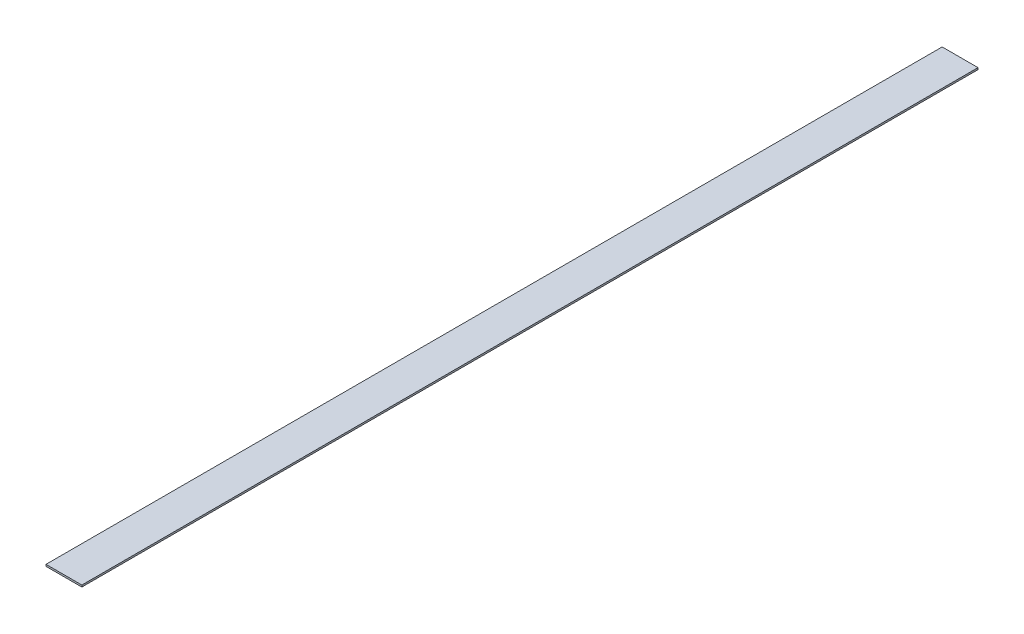
ISO-10303-21;
HEADER;
FILE_DESCRIPTION(('STEP AP214'),'2;1');
FILE_NAME('part.step','',(''),(''),'','','');
FILE_SCHEMA(('AUTOMOTIVE_DESIGN { 1 0 10303 214 1 1 1 1 }'));
ENDSEC;
DATA;
#1=APPLICATION_CONTEXT('core data for automotive mechanical design processes');
#2=APPLICATION_PROTOCOL_DEFINITION('international standard','automotive_design',2000,#1);
#3=PRODUCT_CONTEXT('',#1,'mechanical');
#4=PRODUCT('Part','Part','',(#3));
#5=PRODUCT_RELATED_PRODUCT_CATEGORY('part','',(#4));
#6=PRODUCT_DEFINITION_FORMATION('','',#4);
#7=PRODUCT_DEFINITION_CONTEXT('part definition',#1,'design');
#8=PRODUCT_DEFINITION('design','',#6,#7);
#9=PRODUCT_DEFINITION_SHAPE('','',#8);
#10=(LENGTH_UNIT() NAMED_UNIT(*) SI_UNIT(.MILLI.,.METRE.));
#11=(NAMED_UNIT(*) PLANE_ANGLE_UNIT() SI_UNIT($,.RADIAN.));
#12=(NAMED_UNIT(*) SI_UNIT($,.STERADIAN.) SOLID_ANGLE_UNIT());
#13=UNCERTAINTY_MEASURE_WITH_UNIT(LENGTH_MEASURE(1.E-05),#10,'distance_accuracy_value','');
#14=(GEOMETRIC_REPRESENTATION_CONTEXT(3) GLOBAL_UNCERTAINTY_ASSIGNED_CONTEXT((#13)) GLOBAL_UNIT_ASSIGNED_CONTEXT((#10,
#11,#12)) REPRESENTATION_CONTEXT('',''));
#15=CARTESIAN_POINT('',(0.,0.,0.));
#16=DIRECTION('',(0.,0.,1.));
#17=DIRECTION('',(1.,0.,0.));
#18=AXIS2_PLACEMENT_3D('',#15,#16,#17);
#19=CARTESIAN_POINT('',(-10.,1.,250.));
#20=DIRECTION('',(1.,0.,0.));
#21=DIRECTION('',(0.,0.,-1.));
#22=AXIS2_PLACEMENT_3D('',#19,#20,#21);
#23=PLANE('',#22);
#24=DIRECTION('',(0.,0.,1.));
#25=VECTOR('',#24,1.);
#26=CARTESIAN_POINT('',(-10.,0.,250.));
#27=LINE('',#26,#25);
#28=CARTESIAN_POINT('',(-10.,0.,-250.));
#29=VERTEX_POINT('',#28);
#30=CARTESIAN_POINT('',(-10.,0.,250.));
#31=VERTEX_POINT('',#30);
#32=EDGE_CURVE('E98',#29,#31,#27,.T.);
#33=ORIENTED_EDGE('',*,*,#32,.T.);
#34=DIRECTION('',(0.,-1.,0.));
#35=VECTOR('',#34,1.);
#36=CARTESIAN_POINT('',(-10.,1.,250.));
#37=LINE('',#36,#35);
#38=CARTESIAN_POINT('',(-10.,1.,250.));
#39=VERTEX_POINT('',#38);
#40=EDGE_CURVE('E11',#39,#31,#37,.T.);
#41=ORIENTED_EDGE('',*,*,#40,.F.);
#42=DIRECTION('',(0.,0.,1.));
#43=VECTOR('',#42,1.);
#44=CARTESIAN_POINT('',(-10.,1.,250.));
#45=LINE('',#44,#43);
#46=CARTESIAN_POINT('',(-10.,1.,-250.));
#47=VERTEX_POINT('',#46);
#48=EDGE_CURVE('E86',#47,#39,#45,.T.);
#49=ORIENTED_EDGE('',*,*,#48,.F.);
#50=DIRECTION('',(0.,-1.,0.));
#51=VECTOR('',#50,1.);
#52=CARTESIAN_POINT('',(-10.,1.,-250.));
#53=LINE('',#52,#51);
#54=EDGE_CURVE('E94',#47,#29,#53,.T.);
#55=ORIENTED_EDGE('',*,*,#54,.T.);
#56=EDGE_LOOP('',(#33,#41,#49,#55));
#57=FACE_BOUND('',#56,.T.);
#58=ADVANCED_FACE('F35',(#57),#23,.F.);
#59=CARTESIAN_POINT('',(-10.,1.,250.));
#60=DIRECTION('',(0.,0.,-1.));
#61=DIRECTION('',(-1.,0.,0.));
#62=AXIS2_PLACEMENT_3D('',#59,#60,#61);
#63=PLANE('',#62);
#64=DIRECTION('',(1.,0.,0.));
#65=VECTOR('',#64,1.);
#66=CARTESIAN_POINT('',(-10.,0.,250.));
#67=LINE('',#66,#65);
#68=CARTESIAN_POINT('',(10.,0.,250.));
#69=VERTEX_POINT('',#68);
#70=EDGE_CURVE('E90',#31,#69,#67,.T.);
#71=ORIENTED_EDGE('',*,*,#70,.T.);
#72=DIRECTION('',(0.,-1.,0.));
#73=VECTOR('',#72,1.);
#74=CARTESIAN_POINT('',(10.,1.,250.));
#75=LINE('',#74,#73);
#76=CARTESIAN_POINT('',(10.,1.,250.));
#77=VERTEX_POINT('',#76);
#78=EDGE_CURVE('E43',#77,#69,#75,.T.);
#79=ORIENTED_EDGE('',*,*,#78,.F.);
#80=DIRECTION('',(1.,0.,0.));
#81=VECTOR('',#80,1.);
#82=CARTESIAN_POINT('',(-10.,1.,250.));
#83=LINE('',#82,#81);
#84=EDGE_CURVE('E81',#39,#77,#83,.T.);
#85=ORIENTED_EDGE('',*,*,#84,.F.);
#86=ORIENTED_EDGE('',*,*,#40,.T.);
#87=EDGE_LOOP('',(#71,#79,#85,#86));
#88=FACE_BOUND('',#87,.T.);
#89=ADVANCED_FACE('F89',(#88),#63,.F.);
#90=CARTESIAN_POINT('',(10.,1.,250.));
#91=DIRECTION('',(-1.,0.,0.));
#92=DIRECTION('',(0.,0.,1.));
#93=AXIS2_PLACEMENT_3D('',#90,#91,#92);
#94=PLANE('',#93);
#95=DIRECTION('',(0.,0.,-1.));
#96=VECTOR('',#95,1.);
#97=CARTESIAN_POINT('',(10.,0.,250.));
#98=LINE('',#97,#96);
#99=CARTESIAN_POINT('',(10.,0.,-250.));
#100=VERTEX_POINT('',#99);
#101=EDGE_CURVE('E68',#69,#100,#98,.T.);
#102=ORIENTED_EDGE('',*,*,#101,.T.);
#103=DIRECTION('',(0.,-1.,0.));
#104=VECTOR('',#103,1.);
#105=CARTESIAN_POINT('',(10.,1.,-250.));
#106=LINE('',#105,#104);
#107=CARTESIAN_POINT('',(10.,1.,-250.));
#108=VERTEX_POINT('',#107);
#109=EDGE_CURVE('E91',#108,#100,#106,.T.);
#110=ORIENTED_EDGE('',*,*,#109,.F.);
#111=DIRECTION('',(0.,0.,-1.));
#112=VECTOR('',#111,1.);
#113=CARTESIAN_POINT('',(10.,1.,250.));
#114=LINE('',#113,#112);
#115=EDGE_CURVE('E84',#77,#108,#114,.T.);
#116=ORIENTED_EDGE('',*,*,#115,.F.);
#117=ORIENTED_EDGE('',*,*,#78,.T.);
#118=EDGE_LOOP('',(#102,#110,#116,#117));
#119=FACE_BOUND('',#118,.T.);
#120=ADVANCED_FACE('F92',(#119),#94,.F.);
#121=CARTESIAN_POINT('',(-10.,1.,-250.));
#122=DIRECTION('',(0.,0.,1.));
#123=DIRECTION('',(1.,0.,0.));
#124=AXIS2_PLACEMENT_3D('',#121,#122,#123);
#125=PLANE('',#124);
#126=DIRECTION('',(-1.,0.,0.));
#127=VECTOR('',#126,1.);
#128=CARTESIAN_POINT('',(-10.,0.,-250.));
#129=LINE('',#128,#127);
#130=EDGE_CURVE('E74',#100,#29,#129,.T.);
#131=ORIENTED_EDGE('',*,*,#130,.T.);
#132=ORIENTED_EDGE('',*,*,#54,.F.);
#133=DIRECTION('',(-1.,0.,0.));
#134=VECTOR('',#133,1.);
#135=CARTESIAN_POINT('',(-10.,1.,-250.));
#136=LINE('',#135,#134);
#137=EDGE_CURVE('E51',#108,#47,#136,.T.);
#138=ORIENTED_EDGE('',*,*,#137,.F.);
#139=ORIENTED_EDGE('',*,*,#109,.T.);
#140=EDGE_LOOP('',(#131,#132,#138,#139));
#141=FACE_BOUND('',#140,.T.);
#142=ADVANCED_FACE('F105',(#141),#125,.F.);
#143=CARTESIAN_POINT('',(0.,1.,0.));
#144=DIRECTION('',(0.,-1.,0.));
#145=DIRECTION('',(0.,0.,-1.));
#146=AXIS2_PLACEMENT_3D('',#143,#144,#145);
#147=PLANE('',#146);
#148=ORIENTED_EDGE('',*,*,#48,.T.);
#149=ORIENTED_EDGE('',*,*,#84,.T.);
#150=ORIENTED_EDGE('',*,*,#115,.T.);
#151=ORIENTED_EDGE('',*,*,#137,.T.);
#152=EDGE_LOOP('',(#148,#149,#150,#151));
#153=FACE_BOUND('',#152,.T.);
#154=ADVANCED_FACE('F82',(#153),#147,.F.);
#155=CARTESIAN_POINT('',(0.,0.,0.));
#156=DIRECTION('',(0.,-1.,0.));
#157=DIRECTION('',(0.,0.,-1.));
#158=AXIS2_PLACEMENT_3D('',#155,#156,#157);
#159=PLANE('',#158);
#160=ORIENTED_EDGE('',*,*,#32,.F.);
#161=ORIENTED_EDGE('',*,*,#130,.F.);
#162=ORIENTED_EDGE('',*,*,#101,.F.);
#163=ORIENTED_EDGE('',*,*,#70,.F.);
#164=EDGE_LOOP('',(#160,#161,#162,#163));
#165=FACE_BOUND('',#164,.T.);
#166=ADVANCED_FACE('F108',(#165),#159,.T.);
#167=CLOSED_SHELL('',(#58,#89,#120,#142,#154,#166));
#168=MANIFOLD_SOLID_BREP('B2',#167);
#169=ADVANCED_BREP_SHAPE_REPRESENTATION('',(#18,#168),#14);
#170=SHAPE_DEFINITION_REPRESENTATION(#9,#169);
ENDSEC;
END-ISO-10303-21;
